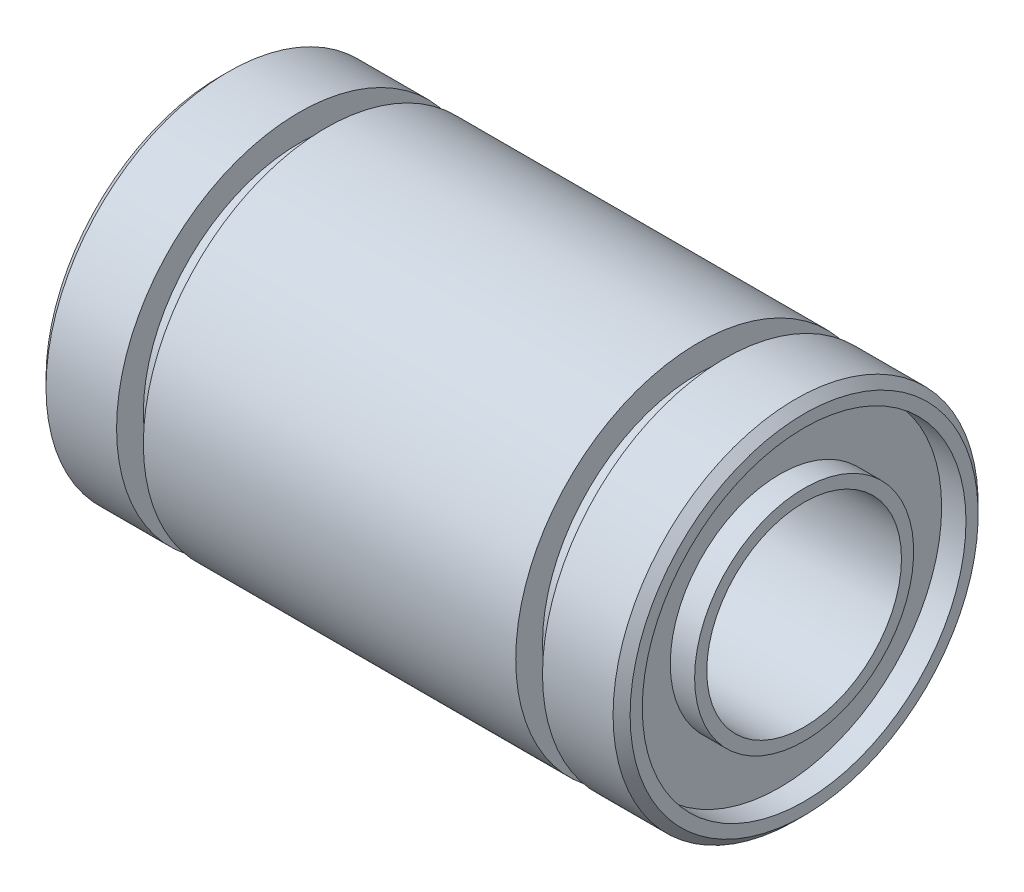
ISO-10303-21;
HEADER;
FILE_DESCRIPTION(('STEP AP214'),'2;1');
FILE_NAME('part.step','',(''),(''),'','','');
FILE_SCHEMA(('AUTOMOTIVE_DESIGN { 1 0 10303 214 1 1 1 1 }'));
ENDSEC;
DATA;
#1=APPLICATION_CONTEXT('core data for automotive mechanical design processes');
#2=APPLICATION_PROTOCOL_DEFINITION('international standard','automotive_design',2000,#1);
#3=PRODUCT_CONTEXT('',#1,'mechanical');
#4=PRODUCT('Part','Part','',(#3));
#5=PRODUCT_RELATED_PRODUCT_CATEGORY('part','',(#4));
#6=PRODUCT_DEFINITION_FORMATION('','',#4);
#7=PRODUCT_DEFINITION_CONTEXT('part definition',#1,'design');
#8=PRODUCT_DEFINITION('design','',#6,#7);
#9=PRODUCT_DEFINITION_SHAPE('','',#8);
#10=(LENGTH_UNIT() NAMED_UNIT(*) SI_UNIT(.MILLI.,.METRE.));
#11=(NAMED_UNIT(*) PLANE_ANGLE_UNIT() SI_UNIT($,.RADIAN.));
#12=(NAMED_UNIT(*) SI_UNIT($,.STERADIAN.) SOLID_ANGLE_UNIT());
#13=UNCERTAINTY_MEASURE_WITH_UNIT(LENGTH_MEASURE(1.E-05),#10,'distance_accuracy_value','');
#14=(GEOMETRIC_REPRESENTATION_CONTEXT(3) GLOBAL_UNCERTAINTY_ASSIGNED_CONTEXT((#13)) GLOBAL_UNIT_ASSIGNED_CONTEXT((#10,
#11,#12)) REPRESENTATION_CONTEXT('',''));
#15=CARTESIAN_POINT('',(0.,0.,0.));
#16=DIRECTION('',(0.,0.,1.));
#17=DIRECTION('',(1.,0.,0.));
#18=AXIS2_PLACEMENT_3D('',#15,#16,#17);
#19=CARTESIAN_POINT('',(11.65,0.,0.));
#20=DIRECTION('',(-1.,0.,0.));
#21=DIRECTION('',(0.,0.,1.));
#22=AXIS2_PLACEMENT_3D('',#19,#20,#21);
#23=CONICAL_SURFACE('',#22,7.5,0.78539816339745);
#24=CARTESIAN_POINT('',(12.,0.,0.));
#25=DIRECTION('',(-1.,0.,0.));
#26=DIRECTION('',(0.,0.,1.));
#27=AXIS2_PLACEMENT_3D('',#24,#25,#26);
#28=CIRCLE('',#27,7.15);
#29=CARTESIAN_POINT('',(12.,0.,7.15));
#30=VERTEX_POINT('',#29);
#31=EDGE_CURVE('E106',#30,#30,#28,.T.);
#32=ORIENTED_EDGE('',*,*,#31,.T.);
#33=EDGE_LOOP('',(#32));
#34=FACE_BOUND('',#33,.T.);
#35=CARTESIAN_POINT('',(11.65,0.,0.));
#36=DIRECTION('',(-1.,0.,0.));
#37=DIRECTION('',(0.,0.,1.));
#38=AXIS2_PLACEMENT_3D('',#35,#36,#37);
#39=CIRCLE('',#38,7.5);
#40=CARTESIAN_POINT('',(11.65,0.,7.5));
#41=VERTEX_POINT('',#40);
#42=EDGE_CURVE('E10',#41,#41,#39,.T.);
#43=ORIENTED_EDGE('',*,*,#42,.F.);
#44=EDGE_LOOP('',(#43));
#45=FACE_BOUND('',#44,.T.);
#46=ADVANCED_FACE('F36',(#34,#45),#23,.T.);
#47=CARTESIAN_POINT('',(-45.6895053247726,0.,0.));
#48=DIRECTION('',(-1.,0.,0.));
#49=DIRECTION('',(0.,0.,1.));
#50=AXIS2_PLACEMENT_3D('',#47,#48,#49);
#51=CYLINDRICAL_SURFACE('',#50,7.5);
#52=CARTESIAN_POINT('',(8.75000000000001,0.,0.));
#53=DIRECTION('',(-1.,0.,0.));
#54=DIRECTION('',(0.,0.,1.));
#55=AXIS2_PLACEMENT_3D('',#52,#53,#54);
#56=CIRCLE('',#55,7.5);
#57=CARTESIAN_POINT('',(8.75000000000001,0.,7.5));
#58=VERTEX_POINT('',#57);
#59=EDGE_CURVE('E42',#58,#58,#56,.T.);
#60=ORIENTED_EDGE('',*,*,#59,.F.);
#61=EDGE_LOOP('',(#60));
#62=FACE_BOUND('',#61,.T.);
#63=ORIENTED_EDGE('',*,*,#42,.T.);
#64=EDGE_LOOP('',(#63));
#65=FACE_BOUND('',#64,.T.);
#66=ADVANCED_FACE('F124',(#62,#65),#51,.T.);
#67=CARTESIAN_POINT('',(8.75000000000001,0.,0.));
#68=DIRECTION('',(1.,0.,0.));
#69=DIRECTION('',(0.,0.,-1.));
#70=AXIS2_PLACEMENT_3D('',#67,#68,#69);
#71=PLANE('',#70);
#72=CARTESIAN_POINT('',(8.75000000000001,0.,0.));
#73=DIRECTION('',(-1.,0.,0.));
#74=DIRECTION('',(0.,0.,1.));
#75=AXIS2_PLACEMENT_3D('',#72,#73,#74);
#76=CIRCLE('',#75,6.4);
#77=CARTESIAN_POINT('',(8.75000000000001,0.,6.4));
#78=VERTEX_POINT('',#77);
#79=EDGE_CURVE('E46',#78,#78,#76,.T.);
#80=ORIENTED_EDGE('',*,*,#79,.F.);
#81=EDGE_LOOP('',(#80));
#82=FACE_BOUND('',#81,.T.);
#83=ORIENTED_EDGE('',*,*,#59,.T.);
#84=EDGE_LOOP('',(#83));
#85=FACE_BOUND('',#84,.T.);
#86=ADVANCED_FACE('F128',(#82,#85),#71,.F.);
#87=CARTESIAN_POINT('',(-45.6895053247726,0.,0.));
#88=DIRECTION('',(-1.,0.,0.));
#89=DIRECTION('',(0.,0.,1.));
#90=AXIS2_PLACEMENT_3D('',#87,#88,#89);
#91=CYLINDRICAL_SURFACE('',#90,6.4);
#92=CARTESIAN_POINT('',(7.65,0.,0.));
#93=DIRECTION('',(-1.,0.,0.));
#94=DIRECTION('',(0.,0.,1.));
#95=AXIS2_PLACEMENT_3D('',#92,#93,#94);
#96=CIRCLE('',#95,6.4);
#97=CARTESIAN_POINT('',(7.65,0.,6.4));
#98=VERTEX_POINT('',#97);
#99=EDGE_CURVE('E50',#98,#98,#96,.T.);
#100=ORIENTED_EDGE('',*,*,#99,.F.);
#101=EDGE_LOOP('',(#100));
#102=FACE_BOUND('',#101,.T.);
#103=ORIENTED_EDGE('',*,*,#79,.T.);
#104=EDGE_LOOP('',(#103));
#105=FACE_BOUND('',#104,.T.);
#106=ADVANCED_FACE('F133',(#102,#105),#91,.T.);
#107=CARTESIAN_POINT('',(7.65,0.,0.));
#108=DIRECTION('',(-1.,0.,0.));
#109=DIRECTION('',(0.,0.,1.));
#110=AXIS2_PLACEMENT_3D('',#107,#108,#109);
#111=PLANE('',#110);
#112=CARTESIAN_POINT('',(7.65,0.,0.));
#113=DIRECTION('',(-1.,0.,0.));
#114=DIRECTION('',(0.,0.,1.));
#115=AXIS2_PLACEMENT_3D('',#112,#113,#114);
#116=CIRCLE('',#115,7.5);
#117=CARTESIAN_POINT('',(7.65,0.,7.5));
#118=VERTEX_POINT('',#117);
#119=EDGE_CURVE('E55',#118,#118,#116,.T.);
#120=ORIENTED_EDGE('',*,*,#119,.F.);
#121=EDGE_LOOP('',(#120));
#122=FACE_BOUND('',#121,.T.);
#123=ORIENTED_EDGE('',*,*,#99,.T.);
#124=EDGE_LOOP('',(#123));
#125=FACE_BOUND('',#124,.T.);
#126=ADVANCED_FACE('F139',(#122,#125),#111,.F.);
#127=CARTESIAN_POINT('',(-45.6895053247726,0.,0.));
#128=DIRECTION('',(-1.,0.,0.));
#129=DIRECTION('',(0.,0.,1.));
#130=AXIS2_PLACEMENT_3D('',#127,#128,#129);
#131=CYLINDRICAL_SURFACE('',#130,7.5);
#132=ORIENTED_EDGE('',*,*,#119,.T.);
#133=EDGE_LOOP('',(#132));
#134=FACE_BOUND('',#133,.T.);
#135=CARTESIAN_POINT('',(-7.65,0.,0.));
#136=DIRECTION('',(-1.,0.,0.));
#137=DIRECTION('',(0.,0.,1.));
#138=AXIS2_PLACEMENT_3D('',#135,#136,#137);
#139=CIRCLE('',#138,7.5);
#140=CARTESIAN_POINT('',(-7.65,0.,7.5));
#141=VERTEX_POINT('',#140);
#142=EDGE_CURVE('E58',#141,#141,#139,.T.);
#143=ORIENTED_EDGE('',*,*,#142,.F.);
#144=EDGE_LOOP('',(#143));
#145=FACE_BOUND('',#144,.T.);
#146=ADVANCED_FACE('F143',(#134,#145),#131,.T.);
#147=CARTESIAN_POINT('',(-7.65,0.,0.));
#148=DIRECTION('',(-1.,0.,0.));
#149=DIRECTION('',(0.,0.,1.));
#150=AXIS2_PLACEMENT_3D('',#147,#148,#149);
#151=PLANE('',#150);
#152=ORIENTED_EDGE('',*,*,#142,.T.);
#153=EDGE_LOOP('',(#152));
#154=FACE_BOUND('',#153,.T.);
#155=CARTESIAN_POINT('',(-7.65,0.,0.));
#156=DIRECTION('',(-1.,0.,0.));
#157=DIRECTION('',(0.,0.,1.));
#158=AXIS2_PLACEMENT_3D('',#155,#156,#157);
#159=CIRCLE('',#158,6.4);
#160=CARTESIAN_POINT('',(-7.65,0.,6.4));
#161=VERTEX_POINT('',#160);
#162=EDGE_CURVE('E61',#161,#161,#159,.T.);
#163=ORIENTED_EDGE('',*,*,#162,.F.);
#164=EDGE_LOOP('',(#163));
#165=FACE_BOUND('',#164,.T.);
#166=ADVANCED_FACE('F147',(#154,#165),#151,.T.);
#167=CARTESIAN_POINT('',(-45.6895053247726,0.,0.));
#168=DIRECTION('',(-1.,0.,0.));
#169=DIRECTION('',(0.,0.,1.));
#170=AXIS2_PLACEMENT_3D('',#167,#168,#169);
#171=CYLINDRICAL_SURFACE('',#170,6.4);
#172=ORIENTED_EDGE('',*,*,#162,.T.);
#173=EDGE_LOOP('',(#172));
#174=FACE_BOUND('',#173,.T.);
#175=CARTESIAN_POINT('',(-8.74999999999999,0.,0.));
#176=DIRECTION('',(-1.,0.,0.));
#177=DIRECTION('',(0.,0.,1.));
#178=AXIS2_PLACEMENT_3D('',#175,#176,#177);
#179=CIRCLE('',#178,6.4);
#180=CARTESIAN_POINT('',(-8.74999999999999,0.,6.4));
#181=VERTEX_POINT('',#180);
#182=EDGE_CURVE('E64',#181,#181,#179,.T.);
#183=ORIENTED_EDGE('',*,*,#182,.F.);
#184=EDGE_LOOP('',(#183));
#185=FACE_BOUND('',#184,.T.);
#186=ADVANCED_FACE('F151',(#174,#185),#171,.T.);
#187=CARTESIAN_POINT('',(-8.75,0.,0.));
#188=DIRECTION('',(1.,0.,0.));
#189=DIRECTION('',(0.,0.,-1.));
#190=AXIS2_PLACEMENT_3D('',#187,#188,#189);
#191=PLANE('',#190);
#192=ORIENTED_EDGE('',*,*,#182,.T.);
#193=EDGE_LOOP('',(#192));
#194=FACE_BOUND('',#193,.T.);
#195=CARTESIAN_POINT('',(-8.74999999999999,0.,0.));
#196=DIRECTION('',(-1.,0.,0.));
#197=DIRECTION('',(0.,0.,1.));
#198=AXIS2_PLACEMENT_3D('',#195,#196,#197);
#199=CIRCLE('',#198,7.5);
#200=CARTESIAN_POINT('',(-8.74999999999999,0.,7.5));
#201=VERTEX_POINT('',#200);
#202=EDGE_CURVE('E67',#201,#201,#199,.T.);
#203=ORIENTED_EDGE('',*,*,#202,.F.);
#204=EDGE_LOOP('',(#203));
#205=FACE_BOUND('',#204,.T.);
#206=ADVANCED_FACE('F155',(#194,#205),#191,.T.);
#207=CARTESIAN_POINT('',(-45.6895053247726,0.,0.));
#208=DIRECTION('',(-1.,0.,0.));
#209=DIRECTION('',(0.,0.,1.));
#210=AXIS2_PLACEMENT_3D('',#207,#208,#209);
#211=CYLINDRICAL_SURFACE('',#210,7.5);
#212=ORIENTED_EDGE('',*,*,#202,.T.);
#213=EDGE_LOOP('',(#212));
#214=FACE_BOUND('',#213,.T.);
#215=CARTESIAN_POINT('',(-11.65,0.,0.));
#216=DIRECTION('',(-1.,0.,0.));
#217=DIRECTION('',(0.,0.,1.));
#218=AXIS2_PLACEMENT_3D('',#215,#216,#217);
#219=CIRCLE('',#218,7.5);
#220=CARTESIAN_POINT('',(-11.65,0.,7.5));
#221=VERTEX_POINT('',#220);
#222=EDGE_CURVE('E70',#221,#221,#219,.T.);
#223=ORIENTED_EDGE('',*,*,#222,.F.);
#224=EDGE_LOOP('',(#223));
#225=FACE_BOUND('',#224,.T.);
#226=ADVANCED_FACE('F159',(#214,#225),#211,.T.);
#227=CARTESIAN_POINT('',(-11.65,0.,0.));
#228=DIRECTION('',(1.,0.,0.));
#229=DIRECTION('',(0.,0.,-1.));
#230=AXIS2_PLACEMENT_3D('',#227,#228,#229);
#231=CONICAL_SURFACE('',#230,7.5,0.78539816339745);
#232=CARTESIAN_POINT('',(-12.,0.,0.));
#233=DIRECTION('',(-1.,0.,0.));
#234=DIRECTION('',(0.,0.,1.));
#235=AXIS2_PLACEMENT_3D('',#232,#233,#234);
#236=CIRCLE('',#235,7.15);
#237=CARTESIAN_POINT('',(-12.,0.,7.15));
#238=VERTEX_POINT('',#237);
#239=EDGE_CURVE('E73',#238,#238,#236,.T.);
#240=ORIENTED_EDGE('',*,*,#239,.F.);
#241=EDGE_LOOP('',(#240));
#242=FACE_BOUND('',#241,.T.);
#243=ORIENTED_EDGE('',*,*,#222,.T.);
#244=EDGE_LOOP('',(#243));
#245=FACE_BOUND('',#244,.T.);
#246=ADVANCED_FACE('F163',(#242,#245),#231,.T.);
#247=CARTESIAN_POINT('',(-12.,0.,0.));
#248=DIRECTION('',(1.,0.,0.));
#249=DIRECTION('',(0.,0.,-1.));
#250=AXIS2_PLACEMENT_3D('',#247,#248,#249);
#251=PLANE('',#250);
#252=CARTESIAN_POINT('',(-12.,0.,0.));
#253=DIRECTION('',(-1.,0.,0.));
#254=DIRECTION('',(0.,0.,1.));
#255=AXIS2_PLACEMENT_3D('',#252,#253,#254);
#256=CIRCLE('',#255,6.65);
#257=CARTESIAN_POINT('',(-12.,0.,6.65));
#258=VERTEX_POINT('',#257);
#259=EDGE_CURVE('E76',#258,#258,#256,.T.);
#260=ORIENTED_EDGE('',*,*,#259,.F.);
#261=EDGE_LOOP('',(#260));
#262=FACE_BOUND('',#261,.T.);
#263=ORIENTED_EDGE('',*,*,#239,.T.);
#264=EDGE_LOOP('',(#263));
#265=FACE_BOUND('',#264,.T.);
#266=ADVANCED_FACE('F167',(#262,#265),#251,.F.);
#267=CARTESIAN_POINT('',(-45.6895053247726,0.,0.));
#268=DIRECTION('',(-1.,0.,0.));
#269=DIRECTION('',(0.,0.,1.));
#270=AXIS2_PLACEMENT_3D('',#267,#268,#269);
#271=CYLINDRICAL_SURFACE('',#270,6.65);
#272=CARTESIAN_POINT('',(-11.,0.,0.));
#273=DIRECTION('',(-1.,0.,0.));
#274=DIRECTION('',(0.,0.,1.));
#275=AXIS2_PLACEMENT_3D('',#272,#273,#274);
#276=CIRCLE('',#275,6.65);
#277=CARTESIAN_POINT('',(-11.,0.,6.65));
#278=VERTEX_POINT('',#277);
#279=EDGE_CURVE('E79',#278,#278,#276,.T.);
#280=ORIENTED_EDGE('',*,*,#279,.F.);
#281=EDGE_LOOP('',(#280));
#282=FACE_BOUND('',#281,.T.);
#283=ORIENTED_EDGE('',*,*,#259,.T.);
#284=EDGE_LOOP('',(#283));
#285=FACE_BOUND('',#284,.T.);
#286=ADVANCED_FACE('F171',(#282,#285),#271,.F.);
#287=CARTESIAN_POINT('',(-11.,0.,0.));
#288=DIRECTION('',(1.,0.,0.));
#289=DIRECTION('',(0.,0.,-1.));
#290=AXIS2_PLACEMENT_3D('',#287,#288,#289);
#291=PLANE('',#290);
#292=CARTESIAN_POINT('',(-11.,0.,0.));
#293=DIRECTION('',(-1.,0.,0.));
#294=DIRECTION('',(0.,0.,1.));
#295=AXIS2_PLACEMENT_3D('',#292,#293,#294);
#296=CIRCLE('',#295,4.5);
#297=CARTESIAN_POINT('',(-11.,0.,4.5));
#298=VERTEX_POINT('',#297);
#299=EDGE_CURVE('E82',#298,#298,#296,.T.);
#300=ORIENTED_EDGE('',*,*,#299,.F.);
#301=EDGE_LOOP('',(#300));
#302=FACE_BOUND('',#301,.T.);
#303=ORIENTED_EDGE('',*,*,#279,.T.);
#304=EDGE_LOOP('',(#303));
#305=FACE_BOUND('',#304,.T.);
#306=ADVANCED_FACE('F175',(#302,#305),#291,.F.);
#307=CARTESIAN_POINT('',(-45.6895053247726,0.,0.));
#308=DIRECTION('',(-1.,0.,0.));
#309=DIRECTION('',(0.,0.,1.));
#310=AXIS2_PLACEMENT_3D('',#307,#308,#309);
#311=CYLINDRICAL_SURFACE('',#310,4.5);
#312=CARTESIAN_POINT('',(-12.,0.,0.));
#313=DIRECTION('',(-1.,0.,0.));
#314=DIRECTION('',(0.,0.,1.));
#315=AXIS2_PLACEMENT_3D('',#312,#313,#314);
#316=CIRCLE('',#315,4.5);
#317=CARTESIAN_POINT('',(-12.,0.,4.5));
#318=VERTEX_POINT('',#317);
#319=EDGE_CURVE('E85',#318,#318,#316,.T.);
#320=ORIENTED_EDGE('',*,*,#319,.F.);
#321=EDGE_LOOP('',(#320));
#322=FACE_BOUND('',#321,.T.);
#323=ORIENTED_EDGE('',*,*,#299,.T.);
#324=EDGE_LOOP('',(#323));
#325=FACE_BOUND('',#324,.T.);
#326=ADVANCED_FACE('F179',(#322,#325),#311,.T.);
#327=CARTESIAN_POINT('',(-12.,0.,0.));
#328=DIRECTION('',(1.,0.,0.));
#329=DIRECTION('',(0.,0.,-1.));
#330=AXIS2_PLACEMENT_3D('',#327,#328,#329);
#331=PLANE('',#330);
#332=CARTESIAN_POINT('',(-12.,0.,0.));
#333=DIRECTION('',(-1.,0.,0.));
#334=DIRECTION('',(0.,0.,1.));
#335=AXIS2_PLACEMENT_3D('',#332,#333,#334);
#336=CIRCLE('',#335,4.);
#337=CARTESIAN_POINT('',(-12.,0.,4.));
#338=VERTEX_POINT('',#337);
#339=EDGE_CURVE('E88',#338,#338,#336,.T.);
#340=ORIENTED_EDGE('',*,*,#339,.F.);
#341=EDGE_LOOP('',(#340));
#342=FACE_BOUND('',#341,.T.);
#343=ORIENTED_EDGE('',*,*,#319,.T.);
#344=EDGE_LOOP('',(#343));
#345=FACE_BOUND('',#344,.T.);
#346=ADVANCED_FACE('F183',(#342,#345),#331,.F.);
#347=CARTESIAN_POINT('',(-45.6895053247726,0.,0.));
#348=DIRECTION('',(-1.,0.,0.));
#349=DIRECTION('',(0.,0.,1.));
#350=AXIS2_PLACEMENT_3D('',#347,#348,#349);
#351=CYLINDRICAL_SURFACE('',#350,4.);
#352=CARTESIAN_POINT('',(12.,0.,0.));
#353=DIRECTION('',(-1.,0.,0.));
#354=DIRECTION('',(0.,0.,1.));
#355=AXIS2_PLACEMENT_3D('',#352,#353,#354);
#356=CIRCLE('',#355,4.);
#357=CARTESIAN_POINT('',(12.,0.,4.));
#358=VERTEX_POINT('',#357);
#359=EDGE_CURVE('E91',#358,#358,#356,.T.);
#360=ORIENTED_EDGE('',*,*,#359,.F.);
#361=EDGE_LOOP('',(#360));
#362=FACE_BOUND('',#361,.T.);
#363=ORIENTED_EDGE('',*,*,#339,.T.);
#364=EDGE_LOOP('',(#363));
#365=FACE_BOUND('',#364,.T.);
#366=ADVANCED_FACE('F187',(#362,#365),#351,.F.);
#367=CARTESIAN_POINT('',(12.,0.,0.));
#368=DIRECTION('',(1.,0.,0.));
#369=DIRECTION('',(0.,0.,-1.));
#370=AXIS2_PLACEMENT_3D('',#367,#368,#369);
#371=PLANE('',#370);
#372=ORIENTED_EDGE('',*,*,#359,.T.);
#373=EDGE_LOOP('',(#372));
#374=FACE_BOUND('',#373,.T.);
#375=CARTESIAN_POINT('',(12.,0.,0.));
#376=DIRECTION('',(-1.,0.,0.));
#377=DIRECTION('',(0.,0.,1.));
#378=AXIS2_PLACEMENT_3D('',#375,#376,#377);
#379=CIRCLE('',#378,4.5);
#380=CARTESIAN_POINT('',(12.,0.,4.5));
#381=VERTEX_POINT('',#380);
#382=EDGE_CURVE('E94',#381,#381,#379,.T.);
#383=ORIENTED_EDGE('',*,*,#382,.F.);
#384=EDGE_LOOP('',(#383));
#385=FACE_BOUND('',#384,.T.);
#386=ADVANCED_FACE('F191',(#374,#385),#371,.T.);
#387=CARTESIAN_POINT('',(-45.6895053247726,0.,0.));
#388=DIRECTION('',(-1.,0.,0.));
#389=DIRECTION('',(0.,0.,1.));
#390=AXIS2_PLACEMENT_3D('',#387,#388,#389);
#391=CYLINDRICAL_SURFACE('',#390,4.5);
#392=ORIENTED_EDGE('',*,*,#382,.T.);
#393=EDGE_LOOP('',(#392));
#394=FACE_BOUND('',#393,.T.);
#395=CARTESIAN_POINT('',(11.,0.,0.));
#396=DIRECTION('',(-1.,0.,0.));
#397=DIRECTION('',(0.,0.,1.));
#398=AXIS2_PLACEMENT_3D('',#395,#396,#397);
#399=CIRCLE('',#398,4.5);
#400=CARTESIAN_POINT('',(11.,0.,4.5));
#401=VERTEX_POINT('',#400);
#402=EDGE_CURVE('E97',#401,#401,#399,.T.);
#403=ORIENTED_EDGE('',*,*,#402,.F.);
#404=EDGE_LOOP('',(#403));
#405=FACE_BOUND('',#404,.T.);
#406=ADVANCED_FACE('F195',(#394,#405),#391,.T.);
#407=CARTESIAN_POINT('',(11.,0.,0.));
#408=DIRECTION('',(1.,0.,0.));
#409=DIRECTION('',(0.,0.,-1.));
#410=AXIS2_PLACEMENT_3D('',#407,#408,#409);
#411=PLANE('',#410);
#412=ORIENTED_EDGE('',*,*,#402,.T.);
#413=EDGE_LOOP('',(#412));
#414=FACE_BOUND('',#413,.T.);
#415=CARTESIAN_POINT('',(11.,0.,0.));
#416=DIRECTION('',(-1.,0.,0.));
#417=DIRECTION('',(0.,0.,1.));
#418=AXIS2_PLACEMENT_3D('',#415,#416,#417);
#419=CIRCLE('',#418,6.65);
#420=CARTESIAN_POINT('',(11.,0.,6.65));
#421=VERTEX_POINT('',#420);
#422=EDGE_CURVE('E100',#421,#421,#419,.T.);
#423=ORIENTED_EDGE('',*,*,#422,.F.);
#424=EDGE_LOOP('',(#423));
#425=FACE_BOUND('',#424,.T.);
#426=ADVANCED_FACE('F120',(#414,#425),#411,.T.);
#427=CARTESIAN_POINT('',(-45.6895053247726,0.,0.));
#428=DIRECTION('',(-1.,0.,0.));
#429=DIRECTION('',(0.,0.,1.));
#430=AXIS2_PLACEMENT_3D('',#427,#428,#429);
#431=CYLINDRICAL_SURFACE('',#430,6.65);
#432=ORIENTED_EDGE('',*,*,#422,.T.);
#433=EDGE_LOOP('',(#432));
#434=FACE_BOUND('',#433,.T.);
#435=CARTESIAN_POINT('',(12.,0.,0.));
#436=DIRECTION('',(-1.,0.,0.));
#437=DIRECTION('',(0.,0.,1.));
#438=AXIS2_PLACEMENT_3D('',#435,#436,#437);
#439=CIRCLE('',#438,6.65);
#440=CARTESIAN_POINT('',(12.,0.,6.65));
#441=VERTEX_POINT('',#440);
#442=EDGE_CURVE('E103',#441,#441,#439,.T.);
#443=ORIENTED_EDGE('',*,*,#442,.F.);
#444=EDGE_LOOP('',(#443));
#445=FACE_BOUND('',#444,.T.);
#446=ADVANCED_FACE('F114',(#434,#445),#431,.F.);
#447=CARTESIAN_POINT('',(12.,0.,0.));
#448=DIRECTION('',(1.,0.,0.));
#449=DIRECTION('',(0.,0.,-1.));
#450=AXIS2_PLACEMENT_3D('',#447,#448,#449);
#451=PLANE('',#450);
#452=ORIENTED_EDGE('',*,*,#442,.T.);
#453=EDGE_LOOP('',(#452));
#454=FACE_BOUND('',#453,.T.);
#455=ORIENTED_EDGE('',*,*,#31,.F.);
#456=EDGE_LOOP('',(#455));
#457=FACE_BOUND('',#456,.T.);
#458=ADVANCED_FACE('F112',(#454,#457),#451,.T.);
#459=CLOSED_SHELL('',(#46,#66,#86,#106,#126,#146,#166,#186,#206,#226,#246,#266,#286,#306,#326,
#346,#366,#386,#406,#426,#446,#458));
#460=MANIFOLD_SOLID_BREP('B2',#459);
#461=ADVANCED_BREP_SHAPE_REPRESENTATION('',(#18,#460),#14);
#462=SHAPE_DEFINITION_REPRESENTATION(#9,#461);
ENDSEC;
END-ISO-10303-21;
